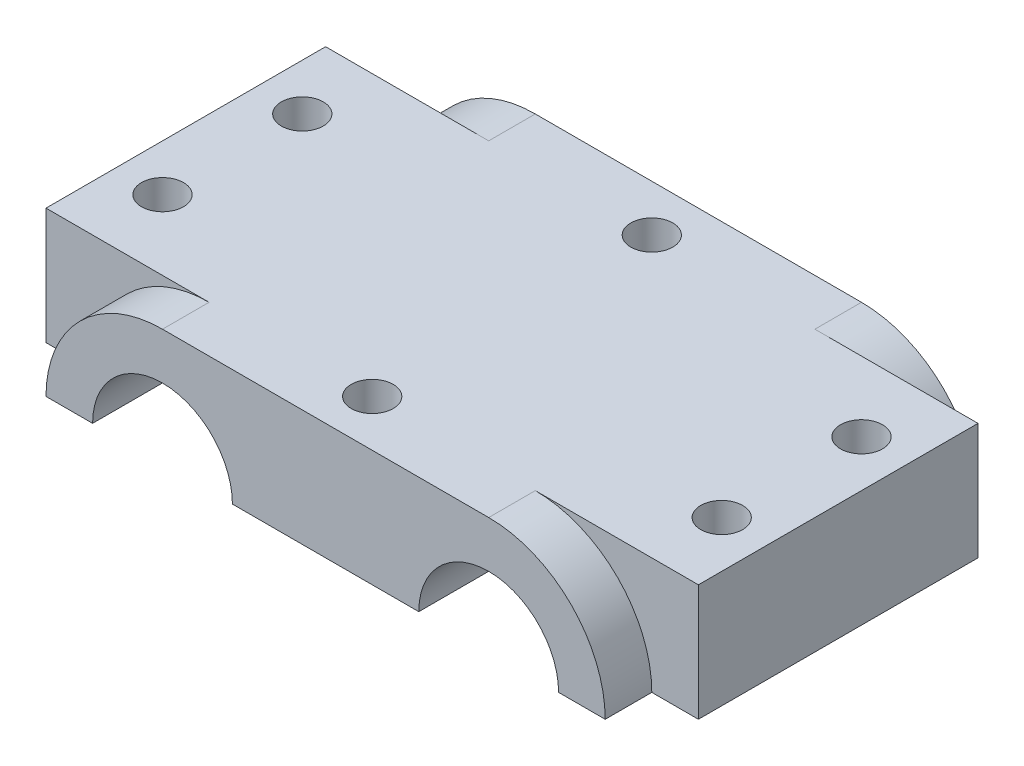
ISO-10303-21;
HEADER;
FILE_DESCRIPTION(('STEP AP214'),'2;1');
FILE_NAME('part.step','',(''),(''),'','','');
FILE_SCHEMA(('AUTOMOTIVE_DESIGN { 1 0 10303 214 1 1 1 1 }'));
ENDSEC;
DATA;
#1=APPLICATION_CONTEXT('core data for automotive mechanical design processes');
#2=APPLICATION_PROTOCOL_DEFINITION('international standard','automotive_design',2000,#1);
#3=PRODUCT_CONTEXT('',#1,'mechanical');
#4=PRODUCT('Part','Part','',(#3));
#5=PRODUCT_RELATED_PRODUCT_CATEGORY('part','',(#4));
#6=PRODUCT_DEFINITION_FORMATION('','',#4);
#7=PRODUCT_DEFINITION_CONTEXT('part definition',#1,'design');
#8=PRODUCT_DEFINITION('design','',#6,#7);
#9=PRODUCT_DEFINITION_SHAPE('','',#8);
#10=(LENGTH_UNIT() NAMED_UNIT(*) SI_UNIT(.MILLI.,.METRE.));
#11=(NAMED_UNIT(*) PLANE_ANGLE_UNIT() SI_UNIT($,.RADIAN.));
#12=(NAMED_UNIT(*) SI_UNIT($,.STERADIAN.) SOLID_ANGLE_UNIT());
#13=UNCERTAINTY_MEASURE_WITH_UNIT(LENGTH_MEASURE(1.E-05),#10,'distance_accuracy_value','');
#14=(GEOMETRIC_REPRESENTATION_CONTEXT(3) GLOBAL_UNCERTAINTY_ASSIGNED_CONTEXT((#13)) GLOBAL_UNIT_ASSIGNED_CONTEXT((#10,
#11,#12)) REPRESENTATION_CONTEXT('',''));
#15=CARTESIAN_POINT('',(0.,0.,0.));
#16=DIRECTION('',(0.,0.,1.));
#17=DIRECTION('',(1.,0.,0.));
#18=AXIS2_PLACEMENT_3D('',#15,#16,#17);
#19=CARTESIAN_POINT('',(30.,0.,5.));
#20=DIRECTION('',(0.,1.,0.));
#21=DIRECTION('',(0.,0.,1.));
#22=AXIS2_PLACEMENT_3D('',#19,#20,#21);
#23=PLANE('',#22);
#24=CARTESIAN_POINT('',(0.,0.,0.));
#25=DIRECTION('',(0.,1.,0.));
#26=DIRECTION('',(0.,0.,1.));
#27=AXIS2_PLACEMENT_3D('',#24,#25,#26);
#28=CIRCLE('',#27,2.25);
#29=CARTESIAN_POINT('',(0.,0.,2.25));
#30=VERTEX_POINT('',#29);
#31=EDGE_CURVE('E243',#30,#30,#28,.T.);
#32=ORIENTED_EDGE('',*,*,#31,.T.);
#33=EDGE_LOOP('',(#32));
#34=FACE_BOUND('',#33,.T.);
#35=DIRECTION('',(0.,0.,-1.));
#36=VECTOR('',#35,1.);
#37=CARTESIAN_POINT('',(-9.99999999999998,0.,5.));
#38=LINE('',#37,#36);
#39=CARTESIAN_POINT('',(-9.99999999999998,0.,5.));
#40=VERTEX_POINT('',#39);
#41=CARTESIAN_POINT('',(-9.99999999999998,0.,-35.));
#42=VERTEX_POINT('',#41);
#43=EDGE_CURVE('E294',#40,#42,#38,.T.);
#44=ORIENTED_EDGE('',*,*,#43,.T.);
#45=DIRECTION('',(1.,0.,0.));
#46=VECTOR('',#45,1.);
#47=CARTESIAN_POINT('',(-9.99999999999997,0.,-35.));
#48=LINE('',#47,#46);
#49=CARTESIAN_POINT('',(9.99999999999997,0.,-35.));
#50=VERTEX_POINT('',#49);
#51=EDGE_CURVE('E201',#42,#50,#48,.T.);
#52=ORIENTED_EDGE('',*,*,#51,.T.);
#53=DIRECTION('',(0.,0.,-1.));
#54=VECTOR('',#53,1.);
#55=CARTESIAN_POINT('',(9.99999999999997,0.,5.));
#56=LINE('',#55,#54);
#57=CARTESIAN_POINT('',(9.99999999999997,0.,5.));
#58=VERTEX_POINT('',#57);
#59=EDGE_CURVE('E292',#58,#50,#56,.T.);
#60=ORIENTED_EDGE('',*,*,#59,.F.);
#61=DIRECTION('',(1.,0.,0.));
#62=VECTOR('',#61,1.);
#63=CARTESIAN_POINT('',(-9.99999999999997,0.,5.));
#64=LINE('',#63,#62);
#65=EDGE_CURVE('E270',#40,#58,#64,.T.);
#66=ORIENTED_EDGE('',*,*,#65,.F.);
#67=EDGE_LOOP('',(#44,#52,#60,#66));
#68=FACE_BOUND('',#67,.T.);
#69=CARTESIAN_POINT('',(0.,0.,-30.));
#70=DIRECTION('',(0.,-1.,0.));
#71=DIRECTION('',(0.,0.,-1.));
#72=AXIS2_PLACEMENT_3D('',#69,#70,#71);
#73=CIRCLE('',#72,2.25);
#74=CARTESIAN_POINT('',(0.,0.,-32.25));
#75=VERTEX_POINT('',#74);
#76=EDGE_CURVE('E173',#75,#75,#73,.T.);
#77=ORIENTED_EDGE('',*,*,#76,.F.);
#78=EDGE_LOOP('',(#77));
#79=FACE_BOUND('',#78,.T.);
#80=ADVANCED_FACE('F38',(#34,#68,#79),#23,.F.);
#81=CARTESIAN_POINT('',(-30.,0.,-7.5));
#82=DIRECTION('',(0.,1.,0.));
#83=DIRECTION('',(0.,0.,1.));
#84=AXIS2_PLACEMENT_3D('',#81,#82,#83);
#85=CIRCLE('',#84,2.25);
#86=CARTESIAN_POINT('',(-30.,0.,-5.25));
#87=VERTEX_POINT('',#86);
#88=EDGE_CURVE('E232',#87,#87,#85,.T.);
#89=ORIENTED_EDGE('',*,*,#88,.T.);
#90=EDGE_LOOP('',(#89));
#91=FACE_BOUND('',#90,.T.);
#92=DIRECTION('',(0.,0.,1.));
#93=VECTOR('',#92,1.);
#94=CARTESIAN_POINT('',(-35.,0.,-15.));
#95=LINE('',#94,#93);
#96=CARTESIAN_POINT('',(-35.,0.,-30.));
#97=VERTEX_POINT('',#96);
#98=CARTESIAN_POINT('',(-35.,0.,0.));
#99=VERTEX_POINT('',#98);
#100=EDGE_CURVE('E256',#97,#99,#95,.T.);
#101=ORIENTED_EDGE('',*,*,#100,.F.);
#102=DIRECTION('',(-1.,0.,0.));
#103=VECTOR('',#102,1.);
#104=CARTESIAN_POINT('',(-35.,0.,-30.));
#105=LINE('',#104,#103);
#106=CARTESIAN_POINT('',(-30.,0.,-30.));
#107=VERTEX_POINT('',#106);
#108=EDGE_CURVE('E171',#107,#97,#105,.T.);
#109=ORIENTED_EDGE('',*,*,#108,.F.);
#110=DIRECTION('',(0.,0.,1.));
#111=VECTOR('',#110,1.);
#112=CARTESIAN_POINT('',(-30.,0.,-35.));
#113=LINE('',#112,#111);
#114=CARTESIAN_POINT('',(-30.,0.,-35.));
#115=VERTEX_POINT('',#114);
#116=EDGE_CURVE('E225',#115,#107,#113,.T.);
#117=ORIENTED_EDGE('',*,*,#116,.F.);
#118=DIRECTION('',(1.,0.,0.));
#119=VECTOR('',#118,1.);
#120=CARTESIAN_POINT('',(-30.,0.,-35.));
#121=LINE('',#120,#119);
#122=CARTESIAN_POINT('',(-25.,0.,-35.));
#123=VERTEX_POINT('',#122);
#124=EDGE_CURVE('E194',#115,#123,#121,.T.);
#125=ORIENTED_EDGE('',*,*,#124,.T.);
#126=DIRECTION('',(0.,0.,-1.));
#127=VECTOR('',#126,1.);
#128=CARTESIAN_POINT('',(-25.,0.,5.));
#129=LINE('',#128,#127);
#130=CARTESIAN_POINT('',(-25.,0.,5.));
#131=VERTEX_POINT('',#130);
#132=EDGE_CURVE('E46',#131,#123,#129,.T.);
#133=ORIENTED_EDGE('',*,*,#132,.F.);
#134=DIRECTION('',(1.,0.,0.));
#135=VECTOR('',#134,1.);
#136=CARTESIAN_POINT('',(-30.,0.,5.));
#137=LINE('',#136,#135);
#138=CARTESIAN_POINT('',(-30.,0.,5.));
#139=VERTEX_POINT('',#138);
#140=EDGE_CURVE('E265',#139,#131,#137,.T.);
#141=ORIENTED_EDGE('',*,*,#140,.F.);
#142=DIRECTION('',(0.,0.,-1.));
#143=VECTOR('',#142,1.);
#144=CARTESIAN_POINT('',(-30.,0.,5.));
#145=LINE('',#144,#143);
#146=CARTESIAN_POINT('',(-30.,0.,0.));
#147=VERTEX_POINT('',#146);
#148=EDGE_CURVE('E11',#139,#147,#145,.T.);
#149=ORIENTED_EDGE('',*,*,#148,.T.);
#150=DIRECTION('',(-1.,0.,0.));
#151=VECTOR('',#150,1.);
#152=CARTESIAN_POINT('',(-35.,0.,0.));
#153=LINE('',#152,#151);
#154=EDGE_CURVE('E252',#147,#99,#153,.T.);
#155=ORIENTED_EDGE('',*,*,#154,.T.);
#156=EDGE_LOOP('',(#101,#109,#117,#125,#133,#141,#149,#155));
#157=FACE_BOUND('',#156,.T.);
#158=CARTESIAN_POINT('',(-30.,0.,-22.5));
#159=DIRECTION('',(0.,-1.,0.));
#160=DIRECTION('',(0.,0.,-1.));
#161=AXIS2_PLACEMENT_3D('',#158,#159,#160);
#162=CIRCLE('',#161,2.25);
#163=CARTESIAN_POINT('',(-30.,0.,-24.75));
#164=VERTEX_POINT('',#163);
#165=EDGE_CURVE('E491',#164,#164,#162,.T.);
#166=ORIENTED_EDGE('',*,*,#165,.F.);
#167=EDGE_LOOP('',(#166));
#168=FACE_BOUND('',#167,.T.);
#169=ADVANCED_FACE('F309',(#91,#157,#168),#23,.F.);
#170=CARTESIAN_POINT('',(-17.5,0.,5.));
#171=DIRECTION('',(0.,0.,-1.));
#172=DIRECTION('',(-1.,0.,0.));
#173=AXIS2_PLACEMENT_3D('',#170,#171,#172);
#174=CYLINDRICAL_SURFACE('',#173,12.5);
#175=CARTESIAN_POINT('',(-17.5,0.,0.));
#176=DIRECTION('',(0.,0.,1.));
#177=DIRECTION('',(-1.,0.,0.));
#178=AXIS2_PLACEMENT_3D('',#175,#176,#177);
#179=CIRCLE('',#178,12.5);
#180=CARTESIAN_POINT('',(-17.5,12.5,0.));
#181=VERTEX_POINT('',#180);
#182=EDGE_CURVE('E163',#181,#147,#179,.T.);
#183=ORIENTED_EDGE('',*,*,#182,.T.);
#184=ORIENTED_EDGE('',*,*,#148,.F.);
#185=CARTESIAN_POINT('',(-17.5,0.,5.));
#186=DIRECTION('',(0.,0.,1.));
#187=DIRECTION('',(-1.,0.,0.));
#188=AXIS2_PLACEMENT_3D('',#185,#186,#187);
#189=CIRCLE('',#188,12.5);
#190=CARTESIAN_POINT('',(-17.5,12.5,5.));
#191=VERTEX_POINT('',#190);
#192=EDGE_CURVE('E263',#191,#139,#189,.T.);
#193=ORIENTED_EDGE('',*,*,#192,.F.);
#194=DIRECTION('',(0.,0.,-1.));
#195=VECTOR('',#194,1.);
#196=CARTESIAN_POINT('',(-17.5,12.5,5.));
#197=LINE('',#196,#195);
#198=EDGE_CURVE('E278',#191,#181,#197,.T.);
#199=ORIENTED_EDGE('',*,*,#198,.T.);
#200=EDGE_LOOP('',(#183,#184,#193,#199));
#201=FACE_BOUND('',#200,.T.);
#202=ADVANCED_FACE('F40',(#201),#174,.T.);
#203=CARTESIAN_POINT('',(-17.5,0.,5.));
#204=DIRECTION('',(0.,0.,-1.));
#205=DIRECTION('',(-1.,0.,0.));
#206=AXIS2_PLACEMENT_3D('',#203,#204,#205);
#207=CYLINDRICAL_SURFACE('',#206,7.5);
#208=ORIENTED_EDGE('',*,*,#132,.T.);
#209=CARTESIAN_POINT('',(-17.5,0.,-35.));
#210=DIRECTION('',(0.,0.,-1.));
#211=DIRECTION('',(-1.,0.,0.));
#212=AXIS2_PLACEMENT_3D('',#209,#210,#211);
#213=CIRCLE('',#212,7.5);
#214=EDGE_CURVE('E198',#123,#42,#213,.T.);
#215=ORIENTED_EDGE('',*,*,#214,.T.);
#216=ORIENTED_EDGE('',*,*,#43,.F.);
#217=CARTESIAN_POINT('',(-17.5,0.,5.));
#218=DIRECTION('',(0.,0.,-1.));
#219=DIRECTION('',(-1.,0.,0.));
#220=AXIS2_PLACEMENT_3D('',#217,#218,#219);
#221=CIRCLE('',#220,7.5);
#222=EDGE_CURVE('E268',#131,#40,#221,.T.);
#223=ORIENTED_EDGE('',*,*,#222,.F.);
#224=EDGE_LOOP('',(#208,#215,#216,#223));
#225=FACE_BOUND('',#224,.T.);
#226=ADVANCED_FACE('F299',(#225),#207,.F.);
#227=CARTESIAN_POINT('',(17.5,0.,5.));
#228=DIRECTION('',(0.,0.,-1.));
#229=DIRECTION('',(-1.,0.,0.));
#230=AXIS2_PLACEMENT_3D('',#227,#228,#229);
#231=CYLINDRICAL_SURFACE('',#230,7.5);
#232=ORIENTED_EDGE('',*,*,#59,.T.);
#233=CARTESIAN_POINT('',(17.5,0.,-35.));
#234=DIRECTION('',(0.,0.,-1.));
#235=DIRECTION('',(1.,0.,0.));
#236=AXIS2_PLACEMENT_3D('',#233,#234,#235);
#237=CIRCLE('',#236,7.5);
#238=CARTESIAN_POINT('',(25.,0.,-35.));
#239=VERTEX_POINT('',#238);
#240=EDGE_CURVE('E204',#50,#239,#237,.T.);
#241=ORIENTED_EDGE('',*,*,#240,.T.);
#242=DIRECTION('',(0.,0.,-1.));
#243=VECTOR('',#242,1.);
#244=CARTESIAN_POINT('',(25.,0.,5.));
#245=LINE('',#244,#243);
#246=CARTESIAN_POINT('',(25.,0.,5.));
#247=VERTEX_POINT('',#246);
#248=EDGE_CURVE('E290',#247,#239,#245,.T.);
#249=ORIENTED_EDGE('',*,*,#248,.F.);
#250=CARTESIAN_POINT('',(17.5,0.,5.));
#251=DIRECTION('',(0.,0.,-1.));
#252=DIRECTION('',(1.,0.,0.));
#253=AXIS2_PLACEMENT_3D('',#250,#251,#252);
#254=CIRCLE('',#253,7.5);
#255=EDGE_CURVE('E272',#58,#247,#254,.T.);
#256=ORIENTED_EDGE('',*,*,#255,.F.);
#257=EDGE_LOOP('',(#232,#241,#249,#256));
#258=FACE_BOUND('',#257,.T.);
#259=ADVANCED_FACE('F325',(#258),#231,.F.);
#260=CARTESIAN_POINT('',(30.,0.,-7.5));
#261=DIRECTION('',(0.,1.,0.));
#262=DIRECTION('',(0.,0.,1.));
#263=AXIS2_PLACEMENT_3D('',#260,#261,#262);
#264=CIRCLE('',#263,2.25);
#265=CARTESIAN_POINT('',(30.,0.,-5.25));
#266=VERTEX_POINT('',#265);
#267=EDGE_CURVE('E240',#266,#266,#264,.T.);
#268=ORIENTED_EDGE('',*,*,#267,.T.);
#269=EDGE_LOOP('',(#268));
#270=FACE_BOUND('',#269,.T.);
#271=ORIENTED_EDGE('',*,*,#248,.T.);
#272=DIRECTION('',(1.,0.,0.));
#273=VECTOR('',#272,1.);
#274=CARTESIAN_POINT('',(30.,0.,-35.));
#275=LINE('',#274,#273);
#276=CARTESIAN_POINT('',(30.,0.,-35.));
#277=VERTEX_POINT('',#276);
#278=EDGE_CURVE('E207',#239,#277,#275,.T.);
#279=ORIENTED_EDGE('',*,*,#278,.T.);
#280=DIRECTION('',(0.,0.,1.));
#281=VECTOR('',#280,1.);
#282=CARTESIAN_POINT('',(30.,0.,-35.));
#283=LINE('',#282,#281);
#284=CARTESIAN_POINT('',(30.,0.,-30.));
#285=VERTEX_POINT('',#284);
#286=EDGE_CURVE('E222',#277,#285,#283,.T.);
#287=ORIENTED_EDGE('',*,*,#286,.T.);
#288=CARTESIAN_POINT('',(35.,0.,-30.));
#289=VERTEX_POINT('',#288);
#290=EDGE_CURVE('E188',#289,#285,#105,.T.);
#291=ORIENTED_EDGE('',*,*,#290,.F.);
#292=DIRECTION('',(0.,0.,1.));
#293=VECTOR('',#292,1.);
#294=CARTESIAN_POINT('',(35.,0.,-15.));
#295=LINE('',#294,#293);
#296=CARTESIAN_POINT('',(35.,0.,0.));
#297=VERTEX_POINT('',#296);
#298=EDGE_CURVE('E258',#289,#297,#295,.T.);
#299=ORIENTED_EDGE('',*,*,#298,.T.);
#300=CARTESIAN_POINT('',(30.,0.,0.));
#301=VERTEX_POINT('',#300);
#302=EDGE_CURVE('E253',#297,#301,#153,.T.);
#303=ORIENTED_EDGE('',*,*,#302,.T.);
#304=DIRECTION('',(0.,0.,-1.));
#305=VECTOR('',#304,1.);
#306=CARTESIAN_POINT('',(30.,0.,5.));
#307=LINE('',#306,#305);
#308=CARTESIAN_POINT('',(30.,0.,5.));
#309=VERTEX_POINT('',#308);
#310=EDGE_CURVE('E287',#309,#301,#307,.T.);
#311=ORIENTED_EDGE('',*,*,#310,.F.);
#312=DIRECTION('',(1.,0.,0.));
#313=VECTOR('',#312,1.);
#314=CARTESIAN_POINT('',(30.,0.,5.));
#315=LINE('',#314,#313);
#316=EDGE_CURVE('E274',#247,#309,#315,.T.);
#317=ORIENTED_EDGE('',*,*,#316,.F.);
#318=EDGE_LOOP('',(#271,#279,#287,#291,#299,#303,#311,#317));
#319=FACE_BOUND('',#318,.T.);
#320=CARTESIAN_POINT('',(30.,0.,-22.5));
#321=DIRECTION('',(0.,-1.,0.));
#322=DIRECTION('',(0.,0.,-1.));
#323=AXIS2_PLACEMENT_3D('',#320,#321,#322);
#324=CIRCLE('',#323,2.25);
#325=CARTESIAN_POINT('',(30.,0.,-24.75));
#326=VERTEX_POINT('',#325);
#327=EDGE_CURVE('E489',#326,#326,#324,.T.);
#328=ORIENTED_EDGE('',*,*,#327,.F.);
#329=EDGE_LOOP('',(#328));
#330=FACE_BOUND('',#329,.T.);
#331=ADVANCED_FACE('F320',(#270,#319,#330),#23,.F.);
#332=CARTESIAN_POINT('',(17.5,0.,5.));
#333=DIRECTION('',(0.,0.,-1.));
#334=DIRECTION('',(-1.,0.,0.));
#335=AXIS2_PLACEMENT_3D('',#332,#333,#334);
#336=CYLINDRICAL_SURFACE('',#335,12.5);
#337=CARTESIAN_POINT('',(17.5,0.,0.));
#338=DIRECTION('',(0.,0.,1.));
#339=DIRECTION('',(1.,0.,0.));
#340=AXIS2_PLACEMENT_3D('',#337,#338,#339);
#341=CIRCLE('',#340,12.5);
#342=CARTESIAN_POINT('',(17.5,12.5,0.));
#343=VERTEX_POINT('',#342);
#344=EDGE_CURVE('E266',#301,#343,#341,.T.);
#345=ORIENTED_EDGE('',*,*,#344,.T.);
#346=DIRECTION('',(0.,0.,-1.));
#347=VECTOR('',#346,1.);
#348=CARTESIAN_POINT('',(17.5,12.5,5.));
#349=LINE('',#348,#347);
#350=CARTESIAN_POINT('',(17.5,12.5,5.));
#351=VERTEX_POINT('',#350);
#352=EDGE_CURVE('E285',#351,#343,#349,.T.);
#353=ORIENTED_EDGE('',*,*,#352,.F.);
#354=CARTESIAN_POINT('',(17.5,0.,5.));
#355=DIRECTION('',(0.,0.,1.));
#356=DIRECTION('',(1.,0.,0.));
#357=AXIS2_PLACEMENT_3D('',#354,#355,#356);
#358=CIRCLE('',#357,12.5);
#359=EDGE_CURVE('E58',#309,#351,#358,.T.);
#360=ORIENTED_EDGE('',*,*,#359,.F.);
#361=ORIENTED_EDGE('',*,*,#310,.T.);
#362=EDGE_LOOP('',(#345,#353,#360,#361));
#363=FACE_BOUND('',#362,.T.);
#364=ADVANCED_FACE('F338',(#363),#336,.T.);
#365=CARTESIAN_POINT('',(-17.5,12.5,5.));
#366=DIRECTION('',(0.,-1.,0.));
#367=DIRECTION('',(0.,0.,-1.));
#368=AXIS2_PLACEMENT_3D('',#365,#366,#367);
#369=PLANE('',#368);
#370=CARTESIAN_POINT('',(0.,12.5,0.));
#371=DIRECTION('',(0.,1.,0.));
#372=DIRECTION('',(0.,0.,1.));
#373=AXIS2_PLACEMENT_3D('',#370,#371,#372);
#374=CIRCLE('',#373,2.25);
#375=CARTESIAN_POINT('',(0.,12.5,2.25));
#376=VERTEX_POINT('',#375);
#377=EDGE_CURVE('E229',#376,#376,#374,.T.);
#378=ORIENTED_EDGE('',*,*,#377,.F.);
#379=EDGE_LOOP('',(#378));
#380=FACE_BOUND('',#379,.T.);
#381=CARTESIAN_POINT('',(30.,12.5,-7.5));
#382=DIRECTION('',(0.,1.,0.));
#383=DIRECTION('',(0.,0.,1.));
#384=AXIS2_PLACEMENT_3D('',#381,#382,#383);
#385=CIRCLE('',#384,2.25);
#386=CARTESIAN_POINT('',(30.,12.5,-5.25));
#387=VERTEX_POINT('',#386);
#388=EDGE_CURVE('E233',#387,#387,#385,.T.);
#389=ORIENTED_EDGE('',*,*,#388,.F.);
#390=EDGE_LOOP('',(#389));
#391=FACE_BOUND('',#390,.T.);
#392=CARTESIAN_POINT('',(-30.,12.5,-7.5));
#393=DIRECTION('',(0.,1.,0.));
#394=DIRECTION('',(0.,0.,-1.));
#395=AXIS2_PLACEMENT_3D('',#392,#393,#394);
#396=CIRCLE('',#395,2.25);
#397=CARTESIAN_POINT('',(-30.,12.5,-9.75));
#398=VERTEX_POINT('',#397);
#399=EDGE_CURVE('E228',#398,#398,#396,.T.);
#400=ORIENTED_EDGE('',*,*,#399,.F.);
#401=EDGE_LOOP('',(#400));
#402=FACE_BOUND('',#401,.T.);
#403=ORIENTED_EDGE('',*,*,#352,.T.);
#404=DIRECTION('',(1.,0.,0.));
#405=VECTOR('',#404,1.);
#406=CARTESIAN_POINT('',(-35.,12.5,0.));
#407=LINE('',#406,#405);
#408=CARTESIAN_POINT('',(35.,12.5,0.));
#409=VERTEX_POINT('',#408);
#410=EDGE_CURVE('E247',#343,#409,#407,.T.);
#411=ORIENTED_EDGE('',*,*,#410,.T.);
#412=DIRECTION('',(0.,0.,1.));
#413=VECTOR('',#412,1.);
#414=CARTESIAN_POINT('',(35.,12.5,-15.));
#415=LINE('',#414,#413);
#416=CARTESIAN_POINT('',(35.,12.5,-30.));
#417=VERTEX_POINT('',#416);
#418=EDGE_CURVE('E164',#417,#409,#415,.T.);
#419=ORIENTED_EDGE('',*,*,#418,.F.);
#420=DIRECTION('',(1.,0.,0.));
#421=VECTOR('',#420,1.);
#422=CARTESIAN_POINT('',(-35.,12.5,-30.));
#423=LINE('',#422,#421);
#424=CARTESIAN_POINT('',(17.5,12.5,-30.));
#425=VERTEX_POINT('',#424);
#426=EDGE_CURVE('E172',#425,#417,#423,.T.);
#427=ORIENTED_EDGE('',*,*,#426,.F.);
#428=DIRECTION('',(0.,0.,1.));
#429=VECTOR('',#428,1.);
#430=CARTESIAN_POINT('',(17.5,12.5,-35.));
#431=LINE('',#430,#429);
#432=CARTESIAN_POINT('',(17.5,12.5,-35.));
#433=VERTEX_POINT('',#432);
#434=EDGE_CURVE('E219',#433,#425,#431,.T.);
#435=ORIENTED_EDGE('',*,*,#434,.F.);
#436=DIRECTION('',(-1.,0.,0.));
#437=VECTOR('',#436,1.);
#438=CARTESIAN_POINT('',(-17.5,12.5,-35.));
#439=LINE('',#438,#437);
#440=CARTESIAN_POINT('',(-17.5,12.5,-35.));
#441=VERTEX_POINT('',#440);
#442=EDGE_CURVE('E213',#433,#441,#439,.T.);
#443=ORIENTED_EDGE('',*,*,#442,.T.);
#444=DIRECTION('',(0.,0.,1.));
#445=VECTOR('',#444,1.);
#446=CARTESIAN_POINT('',(-17.5,12.5,-35.));
#447=LINE('',#446,#445);
#448=CARTESIAN_POINT('',(-17.5,12.5,-30.));
#449=VERTEX_POINT('',#448);
#450=EDGE_CURVE('E179',#441,#449,#447,.T.);
#451=ORIENTED_EDGE('',*,*,#450,.T.);
#452=CARTESIAN_POINT('',(-35.,12.5,-30.));
#453=VERTEX_POINT('',#452);
#454=EDGE_CURVE('E168',#453,#449,#423,.T.);
#455=ORIENTED_EDGE('',*,*,#454,.F.);
#456=DIRECTION('',(0.,0.,1.));
#457=VECTOR('',#456,1.);
#458=CARTESIAN_POINT('',(-35.,12.5,-15.));
#459=LINE('',#458,#457);
#460=CARTESIAN_POINT('',(-35.,12.5,0.));
#461=VERTEX_POINT('',#460);
#462=EDGE_CURVE('E152',#453,#461,#459,.T.);
#463=ORIENTED_EDGE('',*,*,#462,.T.);
#464=EDGE_CURVE('E248',#461,#181,#407,.T.);
#465=ORIENTED_EDGE('',*,*,#464,.T.);
#466=ORIENTED_EDGE('',*,*,#198,.F.);
#467=DIRECTION('',(-1.,0.,0.));
#468=VECTOR('',#467,1.);
#469=CARTESIAN_POINT('',(-17.5,12.5,5.));
#470=LINE('',#469,#468);
#471=EDGE_CURVE('E53',#351,#191,#470,.T.);
#472=ORIENTED_EDGE('',*,*,#471,.F.);
#473=EDGE_LOOP('',(#403,#411,#419,#427,#435,#443,#451,#455,#463,#465,#466,#472));
#474=FACE_BOUND('',#473,.T.);
#475=CARTESIAN_POINT('',(0.,12.5,-30.));
#476=DIRECTION('',(0.,-1.,0.));
#477=DIRECTION('',(0.,0.,-1.));
#478=AXIS2_PLACEMENT_3D('',#475,#476,#477);
#479=CIRCLE('',#478,2.25);
#480=CARTESIAN_POINT('',(0.,12.5,-32.25));
#481=VERTEX_POINT('',#480);
#482=EDGE_CURVE('E486',#481,#481,#479,.T.);
#483=ORIENTED_EDGE('',*,*,#482,.T.);
#484=EDGE_LOOP('',(#483));
#485=FACE_BOUND('',#484,.T.);
#486=CARTESIAN_POINT('',(30.,12.5,-22.5));
#487=DIRECTION('',(0.,-1.,0.));
#488=DIRECTION('',(0.,0.,-1.));
#489=AXIS2_PLACEMENT_3D('',#486,#487,#488);
#490=CIRCLE('',#489,2.25);
#491=CARTESIAN_POINT('',(30.,12.5,-24.75));
#492=VERTEX_POINT('',#491);
#493=EDGE_CURVE('E499',#492,#492,#490,.T.);
#494=ORIENTED_EDGE('',*,*,#493,.T.);
#495=EDGE_LOOP('',(#494));
#496=FACE_BOUND('',#495,.T.);
#497=CARTESIAN_POINT('',(-30.,12.5,-22.5));
#498=DIRECTION('',(0.,-1.,0.));
#499=DIRECTION('',(0.,0.,1.));
#500=AXIS2_PLACEMENT_3D('',#497,#498,#499);
#501=CIRCLE('',#500,2.25);
#502=CARTESIAN_POINT('',(-30.,12.5,-20.25));
#503=VERTEX_POINT('',#502);
#504=EDGE_CURVE('E496',#503,#503,#501,.T.);
#505=ORIENTED_EDGE('',*,*,#504,.T.);
#506=EDGE_LOOP('',(#505));
#507=FACE_BOUND('',#506,.T.);
#508=ADVANCED_FACE('F176',(#380,#391,#402,#474,#485,#496,#507),#369,.F.);
#509=CARTESIAN_POINT('',(-17.5,0.,5.));
#510=DIRECTION('',(0.,0.,-1.));
#511=DIRECTION('',(-1.,0.,0.));
#512=AXIS2_PLACEMENT_3D('',#509,#510,#511);
#513=PLANE('',#512);
#514=ORIENTED_EDGE('',*,*,#192,.T.);
#515=ORIENTED_EDGE('',*,*,#140,.T.);
#516=ORIENTED_EDGE('',*,*,#222,.T.);
#517=ORIENTED_EDGE('',*,*,#65,.T.);
#518=ORIENTED_EDGE('',*,*,#255,.T.);
#519=ORIENTED_EDGE('',*,*,#316,.T.);
#520=ORIENTED_EDGE('',*,*,#359,.T.);
#521=ORIENTED_EDGE('',*,*,#471,.T.);
#522=EDGE_LOOP('',(#514,#515,#516,#517,#518,#519,#520,#521));
#523=FACE_BOUND('',#522,.T.);
#524=ADVANCED_FACE('F331',(#523),#513,.F.);
#525=CARTESIAN_POINT('',(0.,0.,0.));
#526=DIRECTION('',(0.,0.,-1.));
#527=DIRECTION('',(-1.,0.,0.));
#528=AXIS2_PLACEMENT_3D('',#525,#526,#527);
#529=PLANE('',#528);
#530=ORIENTED_EDGE('',*,*,#182,.F.);
#531=ORIENTED_EDGE('',*,*,#464,.F.);
#532=DIRECTION('',(0.,1.,0.));
#533=VECTOR('',#532,1.);
#534=CARTESIAN_POINT('',(-35.,0.,0.));
#535=LINE('',#534,#533);
#536=EDGE_CURVE('E159',#99,#461,#535,.T.);
#537=ORIENTED_EDGE('',*,*,#536,.F.);
#538=ORIENTED_EDGE('',*,*,#154,.F.);
#539=EDGE_LOOP('',(#530,#531,#537,#538));
#540=FACE_BOUND('',#539,.T.);
#541=ADVANCED_FACE('F336',(#540),#529,.F.);
#542=ORIENTED_EDGE('',*,*,#344,.F.);
#543=ORIENTED_EDGE('',*,*,#302,.F.);
#544=DIRECTION('',(0.,-1.,0.));
#545=VECTOR('',#544,1.);
#546=CARTESIAN_POINT('',(35.,0.,0.));
#547=LINE('',#546,#545);
#548=EDGE_CURVE('E250',#409,#297,#547,.T.);
#549=ORIENTED_EDGE('',*,*,#548,.F.);
#550=ORIENTED_EDGE('',*,*,#410,.F.);
#551=EDGE_LOOP('',(#542,#543,#549,#550));
#552=FACE_BOUND('',#551,.T.);
#553=ADVANCED_FACE('F342',(#552),#529,.F.);
#554=CARTESIAN_POINT('',(-35.,0.,-15.));
#555=DIRECTION('',(1.,0.,0.));
#556=DIRECTION('',(0.,0.,-1.));
#557=AXIS2_PLACEMENT_3D('',#554,#555,#556);
#558=PLANE('',#557);
#559=ORIENTED_EDGE('',*,*,#536,.T.);
#560=ORIENTED_EDGE('',*,*,#462,.F.);
#561=DIRECTION('',(0.,1.,0.));
#562=VECTOR('',#561,1.);
#563=CARTESIAN_POINT('',(-35.,0.,-30.));
#564=LINE('',#563,#562);
#565=EDGE_CURVE('E156',#97,#453,#564,.T.);
#566=ORIENTED_EDGE('',*,*,#565,.F.);
#567=ORIENTED_EDGE('',*,*,#100,.T.);
#568=EDGE_LOOP('',(#559,#560,#566,#567));
#569=FACE_BOUND('',#568,.T.);
#570=ADVANCED_FACE('F154',(#569),#558,.F.);
#571=CARTESIAN_POINT('',(35.,0.,-15.));
#572=DIRECTION('',(-1.,0.,0.));
#573=DIRECTION('',(0.,0.,1.));
#574=AXIS2_PLACEMENT_3D('',#571,#572,#573);
#575=PLANE('',#574);
#576=ORIENTED_EDGE('',*,*,#548,.T.);
#577=ORIENTED_EDGE('',*,*,#298,.F.);
#578=DIRECTION('',(0.,-1.,0.));
#579=VECTOR('',#578,1.);
#580=CARTESIAN_POINT('',(35.,0.,-30.));
#581=LINE('',#580,#579);
#582=EDGE_CURVE('E181',#417,#289,#581,.T.);
#583=ORIENTED_EDGE('',*,*,#582,.F.);
#584=ORIENTED_EDGE('',*,*,#418,.T.);
#585=EDGE_LOOP('',(#576,#577,#583,#584));
#586=FACE_BOUND('',#585,.T.);
#587=ADVANCED_FACE('F346',(#586),#575,.F.);
#588=CARTESIAN_POINT('',(-30.,-2.50000000000002,-7.5));
#589=DIRECTION('',(0.,1.,0.));
#590=DIRECTION('',(0.,0.,1.));
#591=AXIS2_PLACEMENT_3D('',#588,#589,#590);
#592=CYLINDRICAL_SURFACE('',#591,2.25);
#593=ORIENTED_EDGE('',*,*,#399,.T.);
#594=EDGE_LOOP('',(#593));
#595=FACE_BOUND('',#594,.T.);
#596=ORIENTED_EDGE('',*,*,#88,.F.);
#597=EDGE_LOOP('',(#596));
#598=FACE_BOUND('',#597,.T.);
#599=ADVANCED_FACE('F382',(#595,#598),#592,.F.);
#600=CARTESIAN_POINT('',(30.,-2.50000000000002,-7.5));
#601=DIRECTION('',(0.,1.,0.));
#602=DIRECTION('',(0.,0.,1.));
#603=AXIS2_PLACEMENT_3D('',#600,#601,#602);
#604=CYLINDRICAL_SURFACE('',#603,2.25);
#605=ORIENTED_EDGE('',*,*,#388,.T.);
#606=EDGE_LOOP('',(#605));
#607=FACE_BOUND('',#606,.T.);
#608=ORIENTED_EDGE('',*,*,#267,.F.);
#609=EDGE_LOOP('',(#608));
#610=FACE_BOUND('',#609,.T.);
#611=ADVANCED_FACE('F379',(#607,#610),#604,.F.);
#612=CARTESIAN_POINT('',(0.,-2.50000000000002,0.));
#613=DIRECTION('',(0.,1.,0.));
#614=DIRECTION('',(0.,0.,1.));
#615=AXIS2_PLACEMENT_3D('',#612,#613,#614);
#616=CYLINDRICAL_SURFACE('',#615,2.25);
#617=ORIENTED_EDGE('',*,*,#377,.T.);
#618=EDGE_LOOP('',(#617));
#619=FACE_BOUND('',#618,.T.);
#620=ORIENTED_EDGE('',*,*,#31,.F.);
#621=EDGE_LOOP('',(#620));
#622=FACE_BOUND('',#621,.T.);
#623=ADVANCED_FACE('F381',(#619,#622),#616,.F.);
#624=CARTESIAN_POINT('',(-17.5,0.,-35.));
#625=DIRECTION('',(0.,0.,1.));
#626=DIRECTION('',(-1.,0.,0.));
#627=AXIS2_PLACEMENT_3D('',#624,#625,#626);
#628=CYLINDRICAL_SURFACE('',#627,12.5);
#629=CARTESIAN_POINT('',(-17.5,0.,-30.));
#630=DIRECTION('',(0.,0.,1.));
#631=DIRECTION('',(-1.,0.,0.));
#632=AXIS2_PLACEMENT_3D('',#629,#630,#631);
#633=CIRCLE('',#632,12.5);
#634=EDGE_CURVE('E191',#449,#107,#633,.T.);
#635=ORIENTED_EDGE('',*,*,#634,.F.);
#636=ORIENTED_EDGE('',*,*,#450,.F.);
#637=CARTESIAN_POINT('',(-17.5,0.,-35.));
#638=DIRECTION('',(0.,0.,1.));
#639=DIRECTION('',(-1.,0.,0.));
#640=AXIS2_PLACEMENT_3D('',#637,#638,#639);
#641=CIRCLE('',#640,12.5);
#642=EDGE_CURVE('E192',#441,#115,#641,.T.);
#643=ORIENTED_EDGE('',*,*,#642,.T.);
#644=ORIENTED_EDGE('',*,*,#116,.T.);
#645=EDGE_LOOP('',(#635,#636,#643,#644));
#646=FACE_BOUND('',#645,.T.);
#647=ADVANCED_FACE('F312',(#646),#628,.T.);
#648=CARTESIAN_POINT('',(17.5,0.,-35.));
#649=DIRECTION('',(0.,0.,1.));
#650=DIRECTION('',(-1.,0.,0.));
#651=AXIS2_PLACEMENT_3D('',#648,#649,#650);
#652=CYLINDRICAL_SURFACE('',#651,12.5);
#653=CARTESIAN_POINT('',(17.5,0.,-30.));
#654=DIRECTION('',(0.,0.,1.));
#655=DIRECTION('',(1.,0.,0.));
#656=AXIS2_PLACEMENT_3D('',#653,#654,#655);
#657=CIRCLE('',#656,12.5);
#658=EDGE_CURVE('E195',#285,#425,#657,.T.);
#659=ORIENTED_EDGE('',*,*,#658,.F.);
#660=ORIENTED_EDGE('',*,*,#286,.F.);
#661=CARTESIAN_POINT('',(17.5,0.,-35.));
#662=DIRECTION('',(0.,0.,1.));
#663=DIRECTION('',(1.,0.,0.));
#664=AXIS2_PLACEMENT_3D('',#661,#662,#663);
#665=CIRCLE('',#664,12.5);
#666=EDGE_CURVE('E210',#277,#433,#665,.T.);
#667=ORIENTED_EDGE('',*,*,#666,.T.);
#668=ORIENTED_EDGE('',*,*,#434,.T.);
#669=EDGE_LOOP('',(#659,#660,#667,#668));
#670=FACE_BOUND('',#669,.T.);
#671=ADVANCED_FACE('F317',(#670),#652,.T.);
#672=CARTESIAN_POINT('',(-17.5,0.,-35.));
#673=DIRECTION('',(0.,0.,1.));
#674=DIRECTION('',(-1.,0.,0.));
#675=AXIS2_PLACEMENT_3D('',#672,#673,#674);
#676=PLANE('',#675);
#677=ORIENTED_EDGE('',*,*,#642,.F.);
#678=ORIENTED_EDGE('',*,*,#442,.F.);
#679=ORIENTED_EDGE('',*,*,#666,.F.);
#680=ORIENTED_EDGE('',*,*,#278,.F.);
#681=ORIENTED_EDGE('',*,*,#240,.F.);
#682=ORIENTED_EDGE('',*,*,#51,.F.);
#683=ORIENTED_EDGE('',*,*,#214,.F.);
#684=ORIENTED_EDGE('',*,*,#124,.F.);
#685=EDGE_LOOP('',(#677,#678,#679,#680,#681,#682,#683,#684));
#686=FACE_BOUND('',#685,.T.);
#687=ADVANCED_FACE('F306',(#686),#676,.F.);
#688=CARTESIAN_POINT('',(0.,0.,-30.));
#689=DIRECTION('',(0.,0.,1.));
#690=DIRECTION('',(-1.,0.,0.));
#691=AXIS2_PLACEMENT_3D('',#688,#689,#690);
#692=PLANE('',#691);
#693=ORIENTED_EDGE('',*,*,#634,.T.);
#694=ORIENTED_EDGE('',*,*,#108,.T.);
#695=ORIENTED_EDGE('',*,*,#565,.T.);
#696=ORIENTED_EDGE('',*,*,#454,.T.);
#697=EDGE_LOOP('',(#693,#694,#695,#696));
#698=FACE_BOUND('',#697,.T.);
#699=ADVANCED_FACE('F167',(#698),#692,.F.);
#700=ORIENTED_EDGE('',*,*,#658,.T.);
#701=ORIENTED_EDGE('',*,*,#426,.T.);
#702=ORIENTED_EDGE('',*,*,#582,.T.);
#703=ORIENTED_EDGE('',*,*,#290,.T.);
#704=EDGE_LOOP('',(#700,#701,#702,#703));
#705=FACE_BOUND('',#704,.T.);
#706=ADVANCED_FACE('F348',(#705),#692,.F.);
#707=CARTESIAN_POINT('',(-30.,-2.50000000000002,-22.5));
#708=DIRECTION('',(0.,1.,0.));
#709=DIRECTION('',(0.,0.,-1.));
#710=AXIS2_PLACEMENT_3D('',#707,#708,#709);
#711=CYLINDRICAL_SURFACE('',#710,2.25);
#712=ORIENTED_EDGE('',*,*,#504,.F.);
#713=EDGE_LOOP('',(#712));
#714=FACE_BOUND('',#713,.T.);
#715=ORIENTED_EDGE('',*,*,#165,.T.);
#716=EDGE_LOOP('',(#715));
#717=FACE_BOUND('',#716,.T.);
#718=ADVANCED_FACE('F350',(#714,#717),#711,.F.);
#719=CARTESIAN_POINT('',(30.,-2.50000000000002,-22.5));
#720=DIRECTION('',(0.,1.,0.));
#721=DIRECTION('',(0.,0.,-1.));
#722=AXIS2_PLACEMENT_3D('',#719,#720,#721);
#723=CYLINDRICAL_SURFACE('',#722,2.25);
#724=ORIENTED_EDGE('',*,*,#493,.F.);
#725=EDGE_LOOP('',(#724));
#726=FACE_BOUND('',#725,.T.);
#727=ORIENTED_EDGE('',*,*,#327,.T.);
#728=EDGE_LOOP('',(#727));
#729=FACE_BOUND('',#728,.T.);
#730=ADVANCED_FACE('F356',(#726,#729),#723,.F.);
#731=CARTESIAN_POINT('',(0.,-2.50000000000002,-30.));
#732=DIRECTION('',(0.,1.,0.));
#733=DIRECTION('',(0.,0.,-1.));
#734=AXIS2_PLACEMENT_3D('',#731,#732,#733);
#735=CYLINDRICAL_SURFACE('',#734,2.25);
#736=ORIENTED_EDGE('',*,*,#482,.F.);
#737=EDGE_LOOP('',(#736));
#738=FACE_BOUND('',#737,.T.);
#739=ORIENTED_EDGE('',*,*,#76,.T.);
#740=EDGE_LOOP('',(#739));
#741=FACE_BOUND('',#740,.T.);
#742=ADVANCED_FACE('F470',(#738,#741),#735,.F.);
#743=CLOSED_SHELL('',(#80,#169,#202,#226,#259,#331,#364,#508,#524,#541,#553,#570,#587,#599,#611,
#623,#647,#671,#687,#699,#706,#718,#730,#742));
#744=MANIFOLD_SOLID_BREP('B2',#743);
#745=ADVANCED_BREP_SHAPE_REPRESENTATION('',(#18,#744),#14);
#746=SHAPE_DEFINITION_REPRESENTATION(#9,#745);
ENDSEC;
END-ISO-10303-21;
